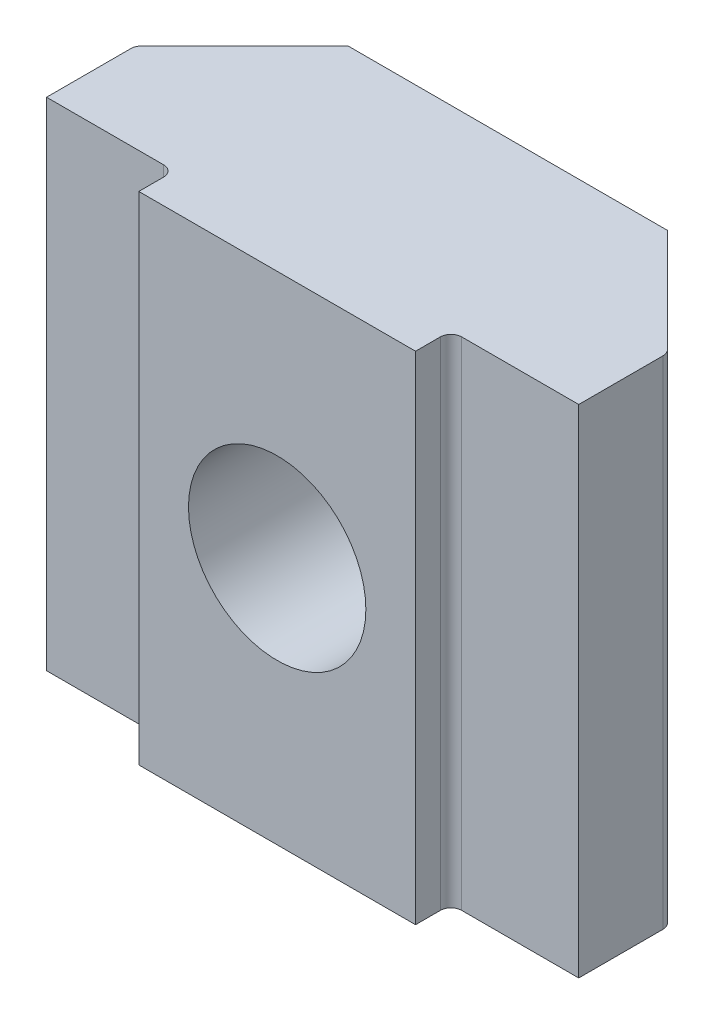
ISO-10303-21;
HEADER;
FILE_DESCRIPTION(('STEP AP214'),'2;1');
FILE_NAME('part.step','',(''),(''),'','','');
FILE_SCHEMA(('AUTOMOTIVE_DESIGN { 1 0 10303 214 1 1 1 1 }'));
ENDSEC;
DATA;
#1=APPLICATION_CONTEXT('core data for automotive mechanical design processes');
#2=APPLICATION_PROTOCOL_DEFINITION('international standard','automotive_design',2000,#1);
#3=PRODUCT_CONTEXT('',#1,'mechanical');
#4=PRODUCT('Part','Part','',(#3));
#5=PRODUCT_RELATED_PRODUCT_CATEGORY('part','',(#4));
#6=PRODUCT_DEFINITION_FORMATION('','',#4);
#7=PRODUCT_DEFINITION_CONTEXT('part definition',#1,'design');
#8=PRODUCT_DEFINITION('design','',#6,#7);
#9=PRODUCT_DEFINITION_SHAPE('','',#8);
#10=(LENGTH_UNIT() NAMED_UNIT(*) SI_UNIT(.MILLI.,.METRE.));
#11=(NAMED_UNIT(*) PLANE_ANGLE_UNIT() SI_UNIT($,.RADIAN.));
#12=(NAMED_UNIT(*) SI_UNIT($,.STERADIAN.) SOLID_ANGLE_UNIT());
#13=UNCERTAINTY_MEASURE_WITH_UNIT(LENGTH_MEASURE(1.E-05),#10,'distance_accuracy_value','');
#14=(GEOMETRIC_REPRESENTATION_CONTEXT(3) GLOBAL_UNCERTAINTY_ASSIGNED_CONTEXT((#13)) GLOBAL_UNIT_ASSIGNED_CONTEXT((#10,
#11,#12)) REPRESENTATION_CONTEXT('',''));
#15=CARTESIAN_POINT('',(0.,0.,0.));
#16=DIRECTION('',(0.,0.,1.));
#17=DIRECTION('',(1.,0.,0.));
#18=AXIS2_PLACEMENT_3D('',#15,#16,#17);
#19=CARTESIAN_POINT('',(0.,0.,0.));
#20=DIRECTION('',(0.,0.,1.));
#21=DIRECTION('',(1.,0.,0.));
#22=AXIS2_PLACEMENT_3D('',#19,#20,#21);
#23=PLANE('',#22);
#24=DIRECTION('',(1.,0.,0.));
#25=VECTOR('',#24,1.);
#26=CARTESIAN_POINT('',(7.5,-7.,0.));
#27=LINE('',#26,#25);
#28=CARTESIAN_POINT('',(-7.5,-7.,0.));
#29=VERTEX_POINT('',#28);
#30=CARTESIAN_POINT('',(-4.2,-7.,0.));
#31=VERTEX_POINT('',#30);
#32=EDGE_CURVE('E211',#29,#31,#27,.T.);
#33=ORIENTED_EDGE('',*,*,#32,.T.);
#34=DIRECTION('',(0.,-1.,0.));
#35=VECTOR('',#34,1.);
#36=CARTESIAN_POINT('',(-4.2,0.,0.));
#37=LINE('',#36,#35);
#38=CARTESIAN_POINT('',(-4.2,7.,0.));
#39=VERTEX_POINT('',#38);
#40=EDGE_CURVE('E238',#31,#39,#37,.F.);
#41=ORIENTED_EDGE('',*,*,#40,.T.);
#42=DIRECTION('',(-1.,0.,0.));
#43=VECTOR('',#42,1.);
#44=CARTESIAN_POINT('',(7.5,7.,0.));
#45=LINE('',#44,#43);
#46=CARTESIAN_POINT('',(-7.5,7.,0.));
#47=VERTEX_POINT('',#46);
#48=EDGE_CURVE('E194',#39,#47,#45,.T.);
#49=ORIENTED_EDGE('',*,*,#48,.T.);
#50=DIRECTION('',(0.,-1.,0.));
#51=VECTOR('',#50,1.);
#52=CARTESIAN_POINT('',(-7.5,-7.,0.));
#53=LINE('',#52,#51);
#54=EDGE_CURVE('E160',#47,#29,#53,.T.);
#55=ORIENTED_EDGE('',*,*,#54,.T.);
#56=EDGE_LOOP('',(#33,#41,#49,#55));
#57=FACE_BOUND('',#56,.T.);
#58=ADVANCED_FACE('F35',(#57),#23,.T.);
#59=CARTESIAN_POINT('',(-7.5,-7.,-5.5));
#60=DIRECTION('',(-1.,0.,0.));
#61=DIRECTION('',(0.,0.,1.));
#62=AXIS2_PLACEMENT_3D('',#59,#60,#61);
#63=PLANE('',#62);
#64=DIRECTION('',(0.,0.,1.));
#65=VECTOR('',#64,1.);
#66=CARTESIAN_POINT('',(-7.5,7.,-5.5));
#67=LINE('',#66,#65);
#68=CARTESIAN_POINT('',(-7.5,7.,-2.37573593128808));
#69=VERTEX_POINT('',#68);
#70=EDGE_CURVE('E180',#69,#47,#67,.T.);
#71=ORIENTED_EDGE('',*,*,#70,.F.);
#72=DIRECTION('',(0.,-1.,0.));
#73=VECTOR('',#72,1.);
#74=CARTESIAN_POINT('',(-7.5,-7.,-2.37573593128808));
#75=LINE('',#74,#73);
#76=CARTESIAN_POINT('',(-7.5,-7.,-2.37573593128808));
#77=VERTEX_POINT('',#76);
#78=EDGE_CURVE('E233',#69,#77,#75,.T.);
#79=ORIENTED_EDGE('',*,*,#78,.T.);
#80=DIRECTION('',(0.,0.,1.));
#81=VECTOR('',#80,1.);
#82=CARTESIAN_POINT('',(-7.5,-7.,-5.5));
#83=LINE('',#82,#81);
#84=EDGE_CURVE('E256',#77,#29,#83,.T.);
#85=ORIENTED_EDGE('',*,*,#84,.T.);
#86=ORIENTED_EDGE('',*,*,#54,.F.);
#87=EDGE_LOOP('',(#71,#79,#85,#86));
#88=FACE_BOUND('',#87,.T.);
#89=ADVANCED_FACE('F255',(#88),#63,.T.);
#90=CARTESIAN_POINT('',(7.5,7.,-5.5));
#91=DIRECTION('',(0.,1.,0.));
#92=DIRECTION('',(-1.,0.,0.));
#93=AXIS2_PLACEMENT_3D('',#90,#91,#92);
#94=PLANE('',#93);
#95=DIRECTION('',(0.,0.,1.));
#96=VECTOR('',#95,1.);
#97=CARTESIAN_POINT('',(7.5,7.,-5.5));
#98=LINE('',#97,#96);
#99=CARTESIAN_POINT('',(7.5,7.,-2.37573593128808));
#100=VERTEX_POINT('',#99);
#101=CARTESIAN_POINT('',(7.5,7.,0.));
#102=VERTEX_POINT('',#101);
#103=EDGE_CURVE('E254',#100,#102,#98,.T.);
#104=ORIENTED_EDGE('',*,*,#103,.F.);
#105=CARTESIAN_POINT('',(7.2,7.,-2.37573593128808));
#106=DIRECTION('',(0.,1.,0.));
#107=DIRECTION('',(-1.,0.,0.));
#108=AXIS2_PLACEMENT_3D('',#105,#106,#107);
#109=CIRCLE('',#108,0.3);
#110=CARTESIAN_POINT('',(7.41213203435596,7.,-2.58786796564404));
#111=VERTEX_POINT('',#110);
#112=EDGE_CURVE('E279',#100,#111,#109,.T.);
#113=ORIENTED_EDGE('',*,*,#112,.T.);
#114=DIRECTION('',(-0.707106781186549,0.,-0.707106781186546));
#115=VECTOR('',#114,1.);
#116=CARTESIAN_POINT('',(6.,7.,-4.));
#117=LINE('',#116,#115);
#118=CARTESIAN_POINT('',(4.49999999999999,7.,-5.5));
#119=VERTEX_POINT('',#118);
#120=EDGE_CURVE('E179',#111,#119,#117,.T.);
#121=ORIENTED_EDGE('',*,*,#120,.T.);
#122=DIRECTION('',(-1.,0.,0.));
#123=VECTOR('',#122,1.);
#124=CARTESIAN_POINT('',(7.5,7.,-5.5));
#125=LINE('',#124,#123);
#126=CARTESIAN_POINT('',(-4.49999999999999,7.,-5.5));
#127=VERTEX_POINT('',#126);
#128=EDGE_CURVE('E258',#119,#127,#125,.T.);
#129=ORIENTED_EDGE('',*,*,#128,.T.);
#130=DIRECTION('',(-0.707106781186549,0.,0.707106781186546));
#131=VECTOR('',#130,1.);
#132=CARTESIAN_POINT('',(1.50000000000003,7.,-11.5));
#133=LINE('',#132,#131);
#134=CARTESIAN_POINT('',(-7.41213203435596,7.,-2.58786796564404));
#135=VERTEX_POINT('',#134);
#136=EDGE_CURVE('E176',#127,#135,#133,.T.);
#137=ORIENTED_EDGE('',*,*,#136,.T.);
#138=CARTESIAN_POINT('',(-7.2,7.,-2.37573593128808));
#139=DIRECTION('',(0.,1.,0.));
#140=DIRECTION('',(-1.,0.,0.));
#141=AXIS2_PLACEMENT_3D('',#138,#139,#140);
#142=CIRCLE('',#141,0.3);
#143=EDGE_CURVE('E193',#135,#69,#142,.T.);
#144=ORIENTED_EDGE('',*,*,#143,.T.);
#145=ORIENTED_EDGE('',*,*,#70,.T.);
#146=ORIENTED_EDGE('',*,*,#48,.F.);
#147=CARTESIAN_POINT('',(-4.2,7.,0.3));
#148=DIRECTION('',(0.,1.,0.));
#149=DIRECTION('',(-1.,0.,0.));
#150=AXIS2_PLACEMENT_3D('',#147,#148,#149);
#151=CIRCLE('',#150,0.3);
#152=CARTESIAN_POINT('',(-3.9,7.,0.3));
#153=VERTEX_POINT('',#152);
#154=EDGE_CURVE('E11',#39,#153,#151,.F.);
#155=ORIENTED_EDGE('',*,*,#154,.T.);
#156=DIRECTION('',(0.,0.,-1.));
#157=VECTOR('',#156,1.);
#158=CARTESIAN_POINT('',(-3.9,7.,1.));
#159=LINE('',#158,#157);
#160=CARTESIAN_POINT('',(-3.9,7.,1.));
#161=VERTEX_POINT('',#160);
#162=EDGE_CURVE('E172',#161,#153,#159,.T.);
#163=ORIENTED_EDGE('',*,*,#162,.F.);
#164=DIRECTION('',(-1.,0.,0.));
#165=VECTOR('',#164,1.);
#166=CARTESIAN_POINT('',(3.9,7.,1.));
#167=LINE('',#166,#165);
#168=CARTESIAN_POINT('',(3.9,7.,1.));
#169=VERTEX_POINT('',#168);
#170=EDGE_CURVE('E150',#169,#161,#167,.T.);
#171=ORIENTED_EDGE('',*,*,#170,.F.);
#172=DIRECTION('',(0.,0.,-1.));
#173=VECTOR('',#172,1.);
#174=CARTESIAN_POINT('',(3.9,7.,1.));
#175=LINE('',#174,#173);
#176=CARTESIAN_POINT('',(3.9,7.,0.3));
#177=VERTEX_POINT('',#176);
#178=EDGE_CURVE('E165',#169,#177,#175,.T.);
#179=ORIENTED_EDGE('',*,*,#178,.T.);
#180=CARTESIAN_POINT('',(4.2,7.,0.3));
#181=DIRECTION('',(0.,1.,0.));
#182=DIRECTION('',(-1.,0.,0.));
#183=AXIS2_PLACEMENT_3D('',#180,#181,#182);
#184=CIRCLE('',#183,0.3);
#185=CARTESIAN_POINT('',(4.2,7.,0.));
#186=VERTEX_POINT('',#185);
#187=EDGE_CURVE('E221',#177,#186,#184,.F.);
#188=ORIENTED_EDGE('',*,*,#187,.T.);
#189=EDGE_CURVE('E197',#102,#186,#45,.T.);
#190=ORIENTED_EDGE('',*,*,#189,.F.);
#191=EDGE_LOOP('',(#104,#113,#121,#129,#137,#144,#145,#146,#155,#163,#171,#179,#188,#190));
#192=FACE_BOUND('',#191,.T.);
#193=ADVANCED_FACE('F219',(#192),#94,.T.);
#194=CARTESIAN_POINT('',(7.5,-7.,-5.5));
#195=DIRECTION('',(1.,0.,0.));
#196=DIRECTION('',(0.,0.,-1.));
#197=AXIS2_PLACEMENT_3D('',#194,#195,#196);
#198=PLANE('',#197);
#199=DIRECTION('',(0.,0.,1.));
#200=VECTOR('',#199,1.);
#201=CARTESIAN_POINT('',(7.5,-7.,-5.5));
#202=LINE('',#201,#200);
#203=CARTESIAN_POINT('',(7.5,-7.,-2.37573593128808));
#204=VERTEX_POINT('',#203);
#205=CARTESIAN_POINT('',(7.5,-7.,0.));
#206=VERTEX_POINT('',#205);
#207=EDGE_CURVE('E257',#204,#206,#202,.T.);
#208=ORIENTED_EDGE('',*,*,#207,.F.);
#209=DIRECTION('',(0.,1.,0.));
#210=VECTOR('',#209,1.);
#211=CARTESIAN_POINT('',(7.5,-7.,-2.37573593128808));
#212=LINE('',#211,#210);
#213=EDGE_CURVE('E190',#204,#100,#212,.T.);
#214=ORIENTED_EDGE('',*,*,#213,.T.);
#215=ORIENTED_EDGE('',*,*,#103,.T.);
#216=DIRECTION('',(0.,1.,0.));
#217=VECTOR('',#216,1.);
#218=CARTESIAN_POINT('',(7.5,-7.,0.));
#219=LINE('',#218,#217);
#220=EDGE_CURVE('E198',#206,#102,#219,.T.);
#221=ORIENTED_EDGE('',*,*,#220,.F.);
#222=EDGE_LOOP('',(#208,#214,#215,#221));
#223=FACE_BOUND('',#222,.T.);
#224=ADVANCED_FACE('F267',(#223),#198,.T.);
#225=CARTESIAN_POINT('',(7.5,-7.,-5.5));
#226=DIRECTION('',(0.,-1.,0.));
#227=DIRECTION('',(1.,0.,0.));
#228=AXIS2_PLACEMENT_3D('',#225,#226,#227);
#229=PLANE('',#228);
#230=DIRECTION('',(0.707106781186549,0.,0.707106781186546));
#231=VECTOR('',#230,1.);
#232=CARTESIAN_POINT('',(6.,-7.,-4.));
#233=LINE('',#232,#231);
#234=CARTESIAN_POINT('',(4.49999999999999,-7.,-5.5));
#235=VERTEX_POINT('',#234);
#236=CARTESIAN_POINT('',(7.41213203435596,-7.,-2.58786796564404));
#237=VERTEX_POINT('',#236);
#238=EDGE_CURVE('E188',#235,#237,#233,.T.);
#239=ORIENTED_EDGE('',*,*,#238,.T.);
#240=CARTESIAN_POINT('',(7.2,-7.,-2.37573593128808));
#241=DIRECTION('',(0.,-1.,0.));
#242=DIRECTION('',(1.,0.,0.));
#243=AXIS2_PLACEMENT_3D('',#240,#241,#242);
#244=CIRCLE('',#243,0.3);
#245=EDGE_CURVE('E275',#237,#204,#244,.T.);
#246=ORIENTED_EDGE('',*,*,#245,.T.);
#247=ORIENTED_EDGE('',*,*,#207,.T.);
#248=CARTESIAN_POINT('',(4.2,-7.,0.));
#249=VERTEX_POINT('',#248);
#250=EDGE_CURVE('E163',#249,#206,#27,.T.);
#251=ORIENTED_EDGE('',*,*,#250,.F.);
#252=CARTESIAN_POINT('',(4.2,-7.,0.3));
#253=DIRECTION('',(0.,-1.,0.));
#254=DIRECTION('',(1.,0.,0.));
#255=AXIS2_PLACEMENT_3D('',#252,#253,#254);
#256=CIRCLE('',#255,0.3);
#257=CARTESIAN_POINT('',(3.9,-7.,0.3));
#258=VERTEX_POINT('',#257);
#259=EDGE_CURVE('E241',#249,#258,#256,.F.);
#260=ORIENTED_EDGE('',*,*,#259,.T.);
#261=DIRECTION('',(0.,0.,-1.));
#262=VECTOR('',#261,1.);
#263=CARTESIAN_POINT('',(3.9,-7.,1.));
#264=LINE('',#263,#262);
#265=CARTESIAN_POINT('',(3.9,-7.,1.));
#266=VERTEX_POINT('',#265);
#267=EDGE_CURVE('E141',#266,#258,#264,.T.);
#268=ORIENTED_EDGE('',*,*,#267,.F.);
#269=DIRECTION('',(1.,0.,0.));
#270=VECTOR('',#269,1.);
#271=CARTESIAN_POINT('',(3.9,-7.,1.));
#272=LINE('',#271,#270);
#273=CARTESIAN_POINT('',(-3.9,-7.,1.));
#274=VERTEX_POINT('',#273);
#275=EDGE_CURVE('E134',#274,#266,#272,.T.);
#276=ORIENTED_EDGE('',*,*,#275,.F.);
#277=DIRECTION('',(0.,0.,-1.));
#278=VECTOR('',#277,1.);
#279=CARTESIAN_POINT('',(-3.9,-7.,1.));
#280=LINE('',#279,#278);
#281=CARTESIAN_POINT('',(-3.9,-7.,0.3));
#282=VERTEX_POINT('',#281);
#283=EDGE_CURVE('E139',#274,#282,#280,.T.);
#284=ORIENTED_EDGE('',*,*,#283,.T.);
#285=CARTESIAN_POINT('',(-4.2,-7.,0.3));
#286=DIRECTION('',(0.,-1.,0.));
#287=DIRECTION('',(1.,0.,0.));
#288=AXIS2_PLACEMENT_3D('',#285,#286,#287);
#289=CIRCLE('',#288,0.3);
#290=EDGE_CURVE('E43',#282,#31,#289,.F.);
#291=ORIENTED_EDGE('',*,*,#290,.T.);
#292=ORIENTED_EDGE('',*,*,#32,.F.);
#293=ORIENTED_EDGE('',*,*,#84,.F.);
#294=CARTESIAN_POINT('',(-7.2,-7.,-2.37573593128808));
#295=DIRECTION('',(0.,-1.,0.));
#296=DIRECTION('',(1.,0.,0.));
#297=AXIS2_PLACEMENT_3D('',#294,#295,#296);
#298=CIRCLE('',#297,0.3);
#299=CARTESIAN_POINT('',(-7.41213203435596,-7.,-2.58786796564404));
#300=VERTEX_POINT('',#299);
#301=EDGE_CURVE('E50',#77,#300,#298,.T.);
#302=ORIENTED_EDGE('',*,*,#301,.T.);
#303=DIRECTION('',(0.707106781186549,0.,-0.707106781186546));
#304=VECTOR('',#303,1.);
#305=CARTESIAN_POINT('',(1.50000000000003,-7.,-11.5));
#306=LINE('',#305,#304);
#307=CARTESIAN_POINT('',(-4.49999999999999,-7.,-5.5));
#308=VERTEX_POINT('',#307);
#309=EDGE_CURVE('E186',#300,#308,#306,.T.);
#310=ORIENTED_EDGE('',*,*,#309,.T.);
#311=DIRECTION('',(1.,0.,0.));
#312=VECTOR('',#311,1.);
#313=CARTESIAN_POINT('',(7.5,-7.,-5.5));
#314=LINE('',#313,#312);
#315=EDGE_CURVE('E210',#308,#235,#314,.T.);
#316=ORIENTED_EDGE('',*,*,#315,.T.);
#317=EDGE_LOOP('',(#239,#246,#247,#251,#260,#268,#276,#284,#291,#292,#293,#302,#310,#316));
#318=FACE_BOUND('',#317,.T.);
#319=ADVANCED_FACE('F137',(#318),#229,.T.);
#320=CARTESIAN_POINT('',(0.,0.,-5.5));
#321=DIRECTION('',(0.,0.,1.));
#322=DIRECTION('',(1.,0.,0.));
#323=AXIS2_PLACEMENT_3D('',#320,#321,#322);
#324=PLANE('',#323);
#325=CARTESIAN_POINT('',(0.,0.,-5.5));
#326=DIRECTION('',(0.,0.,-1.));
#327=DIRECTION('',(-1.,0.,0.));
#328=AXIS2_PLACEMENT_3D('',#325,#326,#327);
#329=CIRCLE('',#328,2.49999999999999);
#330=CARTESIAN_POINT('',(-2.49999999999999,0.,-5.5));
#331=VERTEX_POINT('',#330);
#332=EDGE_CURVE('E294',#331,#331,#329,.T.);
#333=ORIENTED_EDGE('',*,*,#332,.F.);
#334=EDGE_LOOP('',(#333));
#335=FACE_BOUND('',#334,.T.);
#336=ORIENTED_EDGE('',*,*,#128,.F.);
#337=DIRECTION('',(0.,-1.,0.));
#338=VECTOR('',#337,1.);
#339=CARTESIAN_POINT('',(4.49999999999999,-7.,-5.5));
#340=LINE('',#339,#338);
#341=EDGE_CURVE('E184',#119,#235,#340,.T.);
#342=ORIENTED_EDGE('',*,*,#341,.T.);
#343=ORIENTED_EDGE('',*,*,#315,.F.);
#344=DIRECTION('',(0.,1.,0.));
#345=VECTOR('',#344,1.);
#346=CARTESIAN_POINT('',(-4.49999999999999,7.,-5.5));
#347=LINE('',#346,#345);
#348=EDGE_CURVE('E182',#308,#127,#347,.T.);
#349=ORIENTED_EDGE('',*,*,#348,.T.);
#350=EDGE_LOOP('',(#336,#342,#343,#349));
#351=FACE_BOUND('',#350,.T.);
#352=ADVANCED_FACE('F300',(#335,#351),#324,.F.);
#353=ORIENTED_EDGE('',*,*,#189,.T.);
#354=DIRECTION('',(0.,1.,0.));
#355=VECTOR('',#354,1.);
#356=CARTESIAN_POINT('',(4.2,0.,0.));
#357=LINE('',#356,#355);
#358=EDGE_CURVE('E229',#186,#249,#357,.F.);
#359=ORIENTED_EDGE('',*,*,#358,.T.);
#360=ORIENTED_EDGE('',*,*,#250,.T.);
#361=ORIENTED_EDGE('',*,*,#220,.T.);
#362=EDGE_LOOP('',(#353,#359,#360,#361));
#363=FACE_BOUND('',#362,.T.);
#364=ADVANCED_FACE('F270',(#363),#23,.T.);
#365=CARTESIAN_POINT('',(-3.9,-7.,1.));
#366=DIRECTION('',(1.,0.,0.));
#367=DIRECTION('',(0.,0.,-1.));
#368=AXIS2_PLACEMENT_3D('',#365,#366,#367);
#369=PLANE('',#368);
#370=ORIENTED_EDGE('',*,*,#162,.T.);
#371=DIRECTION('',(0.,-1.,0.));
#372=VECTOR('',#371,1.);
#373=CARTESIAN_POINT('',(-3.9,-7.,0.3));
#374=LINE('',#373,#372);
#375=EDGE_CURVE('E159',#153,#282,#374,.T.);
#376=ORIENTED_EDGE('',*,*,#375,.T.);
#377=ORIENTED_EDGE('',*,*,#283,.F.);
#378=DIRECTION('',(0.,-1.,0.));
#379=VECTOR('',#378,1.);
#380=CARTESIAN_POINT('',(-3.9,-7.,1.));
#381=LINE('',#380,#379);
#382=EDGE_CURVE('E145',#161,#274,#381,.T.);
#383=ORIENTED_EDGE('',*,*,#382,.F.);
#384=EDGE_LOOP('',(#370,#376,#377,#383));
#385=FACE_BOUND('',#384,.T.);
#386=ADVANCED_FACE('F157',(#385),#369,.F.);
#387=CARTESIAN_POINT('',(3.9,-7.,1.));
#388=DIRECTION('',(-1.,0.,0.));
#389=DIRECTION('',(0.,0.,1.));
#390=AXIS2_PLACEMENT_3D('',#387,#388,#389);
#391=PLANE('',#390);
#392=ORIENTED_EDGE('',*,*,#267,.T.);
#393=DIRECTION('',(0.,1.,0.));
#394=VECTOR('',#393,1.);
#395=CARTESIAN_POINT('',(3.9,-7.,0.3));
#396=LINE('',#395,#394);
#397=EDGE_CURVE('E226',#258,#177,#396,.T.);
#398=ORIENTED_EDGE('',*,*,#397,.T.);
#399=ORIENTED_EDGE('',*,*,#178,.F.);
#400=DIRECTION('',(0.,1.,0.));
#401=VECTOR('',#400,1.);
#402=CARTESIAN_POINT('',(3.9,-7.,1.));
#403=LINE('',#402,#401);
#404=EDGE_CURVE('E144',#266,#169,#403,.T.);
#405=ORIENTED_EDGE('',*,*,#404,.F.);
#406=EDGE_LOOP('',(#392,#398,#399,#405));
#407=FACE_BOUND('',#406,.T.);
#408=ADVANCED_FACE('F224',(#407),#391,.F.);
#409=CARTESIAN_POINT('',(0.,0.,1.));
#410=DIRECTION('',(0.,0.,1.));
#411=DIRECTION('',(1.,0.,0.));
#412=AXIS2_PLACEMENT_3D('',#409,#410,#411);
#413=PLANE('',#412);
#414=CARTESIAN_POINT('',(0.,0.,1.));
#415=DIRECTION('',(0.,0.,1.));
#416=DIRECTION('',(1.,0.,0.));
#417=AXIS2_PLACEMENT_3D('',#414,#415,#416);
#418=CIRCLE('',#417,2.49999999999999);
#419=CARTESIAN_POINT('',(2.49999999999999,0.,1.));
#420=VERTEX_POINT('',#419);
#421=EDGE_CURVE('E154',#420,#420,#418,.T.);
#422=ORIENTED_EDGE('',*,*,#421,.F.);
#423=EDGE_LOOP('',(#422));
#424=FACE_BOUND('',#423,.T.);
#425=ORIENTED_EDGE('',*,*,#382,.T.);
#426=ORIENTED_EDGE('',*,*,#275,.T.);
#427=ORIENTED_EDGE('',*,*,#404,.T.);
#428=ORIENTED_EDGE('',*,*,#170,.T.);
#429=EDGE_LOOP('',(#425,#426,#427,#428));
#430=FACE_BOUND('',#429,.T.);
#431=ADVANCED_FACE('F148',(#424,#430),#413,.T.);
#432=CARTESIAN_POINT('',(0.,0.,-5.5));
#433=DIRECTION('',(0.,0.,-1.));
#434=DIRECTION('',(-1.,0.,0.));
#435=AXIS2_PLACEMENT_3D('',#432,#433,#434);
#436=CYLINDRICAL_SURFACE('',#435,2.49999999999999);
#437=ORIENTED_EDGE('',*,*,#421,.T.);
#438=EDGE_LOOP('',(#437));
#439=FACE_BOUND('',#438,.T.);
#440=ORIENTED_EDGE('',*,*,#332,.T.);
#441=EDGE_LOOP('',(#440));
#442=FACE_BOUND('',#441,.T.);
#443=ADVANCED_FACE('F298',(#439,#442),#436,.F.);
#444=CARTESIAN_POINT('',(7.5,-7.,-2.5));
#445=DIRECTION('',(0.707106781186546,0.,-0.707106781186549));
#446=DIRECTION('',(0.,-1.,0.));
#447=AXIS2_PLACEMENT_3D('',#444,#445,#446);
#448=PLANE('',#447);
#449=ORIENTED_EDGE('',*,*,#120,.F.);
#450=DIRECTION('',(0.,1.,0.));
#451=VECTOR('',#450,1.);
#452=CARTESIAN_POINT('',(7.41213203435596,-7.,-2.58786796564404));
#453=LINE('',#452,#451);
#454=EDGE_CURVE('E280',#111,#237,#453,.F.);
#455=ORIENTED_EDGE('',*,*,#454,.T.);
#456=ORIENTED_EDGE('',*,*,#238,.F.);
#457=ORIENTED_EDGE('',*,*,#341,.F.);
#458=EDGE_LOOP('',(#449,#455,#456,#457));
#459=FACE_BOUND('',#458,.T.);
#460=ADVANCED_FACE('F311',(#459),#448,.T.);
#461=CARTESIAN_POINT('',(-7.5,-7.,-2.5));
#462=DIRECTION('',(-0.707106781186546,0.,-0.707106781186549));
#463=DIRECTION('',(0.,1.,0.));
#464=AXIS2_PLACEMENT_3D('',#461,#462,#463);
#465=PLANE('',#464);
#466=ORIENTED_EDGE('',*,*,#309,.F.);
#467=DIRECTION('',(0.,-1.,0.));
#468=VECTOR('',#467,1.);
#469=CARTESIAN_POINT('',(-7.41213203435596,-7.,-2.58786796564404));
#470=LINE('',#469,#468);
#471=EDGE_CURVE('E230',#300,#135,#470,.F.);
#472=ORIENTED_EDGE('',*,*,#471,.T.);
#473=ORIENTED_EDGE('',*,*,#136,.F.);
#474=ORIENTED_EDGE('',*,*,#348,.F.);
#475=EDGE_LOOP('',(#466,#472,#473,#474));
#476=FACE_BOUND('',#475,.T.);
#477=ADVANCED_FACE('F313',(#476),#465,.T.);
#478=CARTESIAN_POINT('',(7.2,-7.,-2.37573593128808));
#479=DIRECTION('',(0.,1.,0.));
#480=DIRECTION('',(0.,0.,1.));
#481=AXIS2_PLACEMENT_3D('',#478,#479,#480);
#482=CYLINDRICAL_SURFACE('',#481,0.3);
#483=ORIENTED_EDGE('',*,*,#245,.F.);
#484=ORIENTED_EDGE('',*,*,#454,.F.);
#485=ORIENTED_EDGE('',*,*,#112,.F.);
#486=ORIENTED_EDGE('',*,*,#213,.F.);
#487=EDGE_LOOP('',(#483,#484,#485,#486));
#488=FACE_BOUND('',#487,.T.);
#489=ADVANCED_FACE('F277',(#488),#482,.T.);
#490=CARTESIAN_POINT('',(-7.2,-7.,-2.37573593128808));
#491=DIRECTION('',(0.,-1.,0.));
#492=DIRECTION('',(0.,0.,-1.));
#493=AXIS2_PLACEMENT_3D('',#490,#491,#492);
#494=CYLINDRICAL_SURFACE('',#493,0.3);
#495=ORIENTED_EDGE('',*,*,#143,.F.);
#496=ORIENTED_EDGE('',*,*,#471,.F.);
#497=ORIENTED_EDGE('',*,*,#301,.F.);
#498=ORIENTED_EDGE('',*,*,#78,.F.);
#499=EDGE_LOOP('',(#495,#496,#497,#498));
#500=FACE_BOUND('',#499,.T.);
#501=ADVANCED_FACE('F314',(#500),#494,.T.);
#502=CARTESIAN_POINT('',(4.2,-7.,0.3));
#503=DIRECTION('',(0.,1.,0.));
#504=DIRECTION('',(0.,0.,1.));
#505=AXIS2_PLACEMENT_3D('',#502,#503,#504);
#506=CYLINDRICAL_SURFACE('',#505,0.3);
#507=ORIENTED_EDGE('',*,*,#259,.F.);
#508=ORIENTED_EDGE('',*,*,#358,.F.);
#509=ORIENTED_EDGE('',*,*,#187,.F.);
#510=ORIENTED_EDGE('',*,*,#397,.F.);
#511=EDGE_LOOP('',(#507,#508,#509,#510));
#512=FACE_BOUND('',#511,.T.);
#513=ADVANCED_FACE('F316',(#512),#506,.F.);
#514=CARTESIAN_POINT('',(-4.2,-7.,0.3));
#515=DIRECTION('',(0.,-1.,0.));
#516=DIRECTION('',(0.,0.,-1.));
#517=AXIS2_PLACEMENT_3D('',#514,#515,#516);
#518=CYLINDRICAL_SURFACE('',#517,0.3);
#519=ORIENTED_EDGE('',*,*,#154,.F.);
#520=ORIENTED_EDGE('',*,*,#40,.F.);
#521=ORIENTED_EDGE('',*,*,#290,.F.);
#522=ORIENTED_EDGE('',*,*,#375,.F.);
#523=EDGE_LOOP('',(#519,#520,#521,#522));
#524=FACE_BOUND('',#523,.T.);
#525=ADVANCED_FACE('F37',(#524),#518,.F.);
#526=CLOSED_SHELL('',(#58,#89,#193,#224,#319,#352,#364,#386,#408,#431,#443,#460,#477,#489,#501,
#513,#525));
#527=MANIFOLD_SOLID_BREP('B2',#526);
#528=ADVANCED_BREP_SHAPE_REPRESENTATION('',(#18,#527),#14);
#529=SHAPE_DEFINITION_REPRESENTATION(#9,#528);
ENDSEC;
END-ISO-10303-21;
